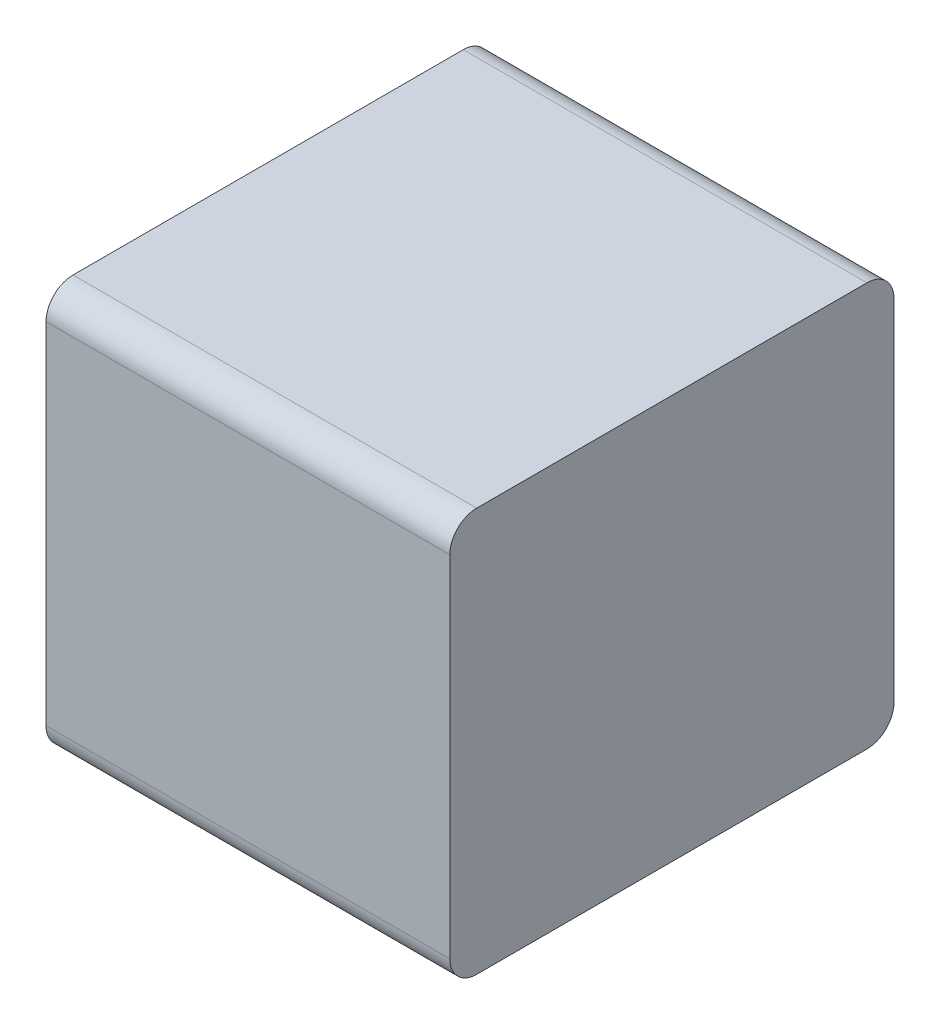
ISO-10303-21;
HEADER;
FILE_DESCRIPTION(('STEP AP214'),'2;1');
FILE_NAME('part.step','',(''),(''),'','','');
FILE_SCHEMA(('AUTOMOTIVE_DESIGN { 1 0 10303 214 1 1 1 1 }'));
ENDSEC;
DATA;
#1=APPLICATION_CONTEXT('core data for automotive mechanical design processes');
#2=APPLICATION_PROTOCOL_DEFINITION('international standard','automotive_design',2000,#1);
#3=PRODUCT_CONTEXT('',#1,'mechanical');
#4=PRODUCT('Part','Part','',(#3));
#5=PRODUCT_RELATED_PRODUCT_CATEGORY('part','',(#4));
#6=PRODUCT_DEFINITION_FORMATION('','',#4);
#7=PRODUCT_DEFINITION_CONTEXT('part definition',#1,'design');
#8=PRODUCT_DEFINITION('design','',#6,#7);
#9=PRODUCT_DEFINITION_SHAPE('','',#8);
#10=(LENGTH_UNIT() NAMED_UNIT(*) SI_UNIT(.MILLI.,.METRE.));
#11=(NAMED_UNIT(*) PLANE_ANGLE_UNIT() SI_UNIT($,.RADIAN.));
#12=(NAMED_UNIT(*) SI_UNIT($,.STERADIAN.) SOLID_ANGLE_UNIT());
#13=UNCERTAINTY_MEASURE_WITH_UNIT(LENGTH_MEASURE(1.E-05),#10,'distance_accuracy_value','');
#14=(GEOMETRIC_REPRESENTATION_CONTEXT(3) GLOBAL_UNCERTAINTY_ASSIGNED_CONTEXT((#13)) GLOBAL_UNIT_ASSIGNED_CONTEXT((#10,
#11,#12)) REPRESENTATION_CONTEXT('',''));
#15=CARTESIAN_POINT('',(0.,0.,0.));
#16=DIRECTION('',(0.,0.,1.));
#17=DIRECTION('',(1.,0.,0.));
#18=AXIS2_PLACEMENT_3D('',#15,#16,#17);
#19=CARTESIAN_POINT('',(0.0749999999999999,0.13,0.02));
#20=DIRECTION('',(1.,0.,0.));
#21=DIRECTION('',(0.,0.707106781186547,-0.707106781186548));
#22=AXIS2_PLACEMENT_3D('',#19,#20,#21);
#23=CYLINDRICAL_SURFACE('',#22,0.02);
#24=CARTESIAN_POINT('',(0.15,0.13,0.02));
#25=DIRECTION('',(-1.,0.,0.));
#26=DIRECTION('',(0.,0.707106781186547,-0.707106781186548));
#27=AXIS2_PLACEMENT_3D('',#24,#25,#26);
#28=CIRCLE('',#27,0.02);
#29=CARTESIAN_POINT('',(0.15,0.15,0.02));
#30=VERTEX_POINT('',#29);
#31=CARTESIAN_POINT('',(0.15,0.13,0.));
#32=VERTEX_POINT('',#31);
#33=EDGE_CURVE('E11',#30,#32,#28,.T.);
#34=ORIENTED_EDGE('',*,*,#33,.T.);
#35=DIRECTION('',(-1.,0.,0.));
#36=VECTOR('',#35,1.);
#37=CARTESIAN_POINT('',(0.0749999999999999,0.13,0.));
#38=LINE('',#37,#36);
#39=CARTESIAN_POINT('',(-0.15,0.13,0.));
#40=VERTEX_POINT('',#39);
#41=EDGE_CURVE('E24',#32,#40,#38,.T.);
#42=ORIENTED_EDGE('',*,*,#41,.T.);
#43=CARTESIAN_POINT('',(-0.15,0.13,0.02));
#44=DIRECTION('',(1.,0.,0.));
#45=DIRECTION('',(0.,0.707106781186547,-0.707106781186548));
#46=AXIS2_PLACEMENT_3D('',#43,#44,#45);
#47=CIRCLE('',#46,0.02);
#48=CARTESIAN_POINT('',(-0.15,0.15,0.02));
#49=VERTEX_POINT('',#48);
#50=EDGE_CURVE('E142',#40,#49,#47,.T.);
#51=ORIENTED_EDGE('',*,*,#50,.T.);
#52=DIRECTION('',(1.,0.,0.));
#53=VECTOR('',#52,1.);
#54=CARTESIAN_POINT('',(0.0749999999999999,0.15,0.02));
#55=LINE('',#54,#53);
#56=EDGE_CURVE('E140',#49,#30,#55,.T.);
#57=ORIENTED_EDGE('',*,*,#56,.T.);
#58=EDGE_LOOP('',(#34,#42,#51,#57));
#59=FACE_BOUND('',#58,.T.);
#60=ADVANCED_FACE('F17',(#59),#23,.T.);
#61=CARTESIAN_POINT('',(0.15,0.15,0.));
#62=DIRECTION('',(0.,1.,0.));
#63=DIRECTION('',(-1.,0.,0.));
#64=AXIS2_PLACEMENT_3D('',#61,#62,#63);
#65=PLANE('',#64);
#66=ORIENTED_EDGE('',*,*,#56,.F.);
#67=DIRECTION('',(0.,0.,1.));
#68=VECTOR('',#67,1.);
#69=CARTESIAN_POINT('',(-0.15,0.15,0.));
#70=LINE('',#69,#68);
#71=CARTESIAN_POINT('',(-0.15,0.15,0.31));
#72=VERTEX_POINT('',#71);
#73=EDGE_CURVE('E138',#49,#72,#70,.T.);
#74=ORIENTED_EDGE('',*,*,#73,.T.);
#75=DIRECTION('',(-1.,0.,0.));
#76=VECTOR('',#75,1.);
#77=CARTESIAN_POINT('',(0.0749999999999999,0.15,0.31));
#78=LINE('',#77,#76);
#79=CARTESIAN_POINT('',(0.15,0.15,0.31));
#80=VERTEX_POINT('',#79);
#81=EDGE_CURVE('E135',#80,#72,#78,.T.);
#82=ORIENTED_EDGE('',*,*,#81,.F.);
#83=DIRECTION('',(0.,0.,1.));
#84=VECTOR('',#83,1.);
#85=CARTESIAN_POINT('',(0.15,0.15,0.));
#86=LINE('',#85,#84);
#87=EDGE_CURVE('E133',#30,#80,#86,.T.);
#88=ORIENTED_EDGE('',*,*,#87,.F.);
#89=EDGE_LOOP('',(#66,#74,#82,#88));
#90=FACE_BOUND('',#89,.T.);
#91=ADVANCED_FACE('F163',(#90),#65,.T.);
#92=CARTESIAN_POINT('',(-0.15,0.15,0.));
#93=DIRECTION('',(-1.,0.,0.));
#94=DIRECTION('',(0.,-1.,0.));
#95=AXIS2_PLACEMENT_3D('',#92,#93,#94);
#96=PLANE('',#95);
#97=ORIENTED_EDGE('',*,*,#50,.F.);
#98=DIRECTION('',(0.,1.,0.));
#99=VECTOR('',#98,1.);
#100=CARTESIAN_POINT('',(-0.15,-0.15,0.));
#101=LINE('',#100,#99);
#102=CARTESIAN_POINT('',(-0.15,-0.13,0.));
#103=VERTEX_POINT('',#102);
#104=EDGE_CURVE('E130',#103,#40,#101,.T.);
#105=ORIENTED_EDGE('',*,*,#104,.F.);
#106=CARTESIAN_POINT('',(-0.15,-0.13,0.02));
#107=DIRECTION('',(1.,0.,0.));
#108=DIRECTION('',(0.,-0.707106781186548,-0.707106781186547));
#109=AXIS2_PLACEMENT_3D('',#106,#107,#108);
#110=CIRCLE('',#109,0.02);
#111=CARTESIAN_POINT('',(-0.15,-0.15,0.02));
#112=VERTEX_POINT('',#111);
#113=EDGE_CURVE('E127',#112,#103,#110,.T.);
#114=ORIENTED_EDGE('',*,*,#113,.F.);
#115=DIRECTION('',(0.,0.,1.));
#116=VECTOR('',#115,1.);
#117=CARTESIAN_POINT('',(-0.15,-0.15,0.));
#118=LINE('',#117,#116);
#119=CARTESIAN_POINT('',(-0.15,-0.15,0.31));
#120=VERTEX_POINT('',#119);
#121=EDGE_CURVE('E125',#112,#120,#118,.T.);
#122=ORIENTED_EDGE('',*,*,#121,.T.);
#123=CARTESIAN_POINT('',(-0.15,-0.13,0.31));
#124=DIRECTION('',(1.,0.,0.));
#125=DIRECTION('',(0.,-0.707106781186548,0.707106781186548));
#126=AXIS2_PLACEMENT_3D('',#123,#124,#125);
#127=CIRCLE('',#126,0.02);
#128=CARTESIAN_POINT('',(-0.15,-0.13,0.33));
#129=VERTEX_POINT('',#128);
#130=EDGE_CURVE('E123',#129,#120,#127,.T.);
#131=ORIENTED_EDGE('',*,*,#130,.F.);
#132=DIRECTION('',(0.,-1.,0.));
#133=VECTOR('',#132,1.);
#134=CARTESIAN_POINT('',(-0.15,-0.15,0.33));
#135=LINE('',#134,#133);
#136=CARTESIAN_POINT('',(-0.15,0.13,0.33));
#137=VERTEX_POINT('',#136);
#138=EDGE_CURVE('E101',#137,#129,#135,.T.);
#139=ORIENTED_EDGE('',*,*,#138,.F.);
#140=CARTESIAN_POINT('',(-0.15,0.13,0.31));
#141=DIRECTION('',(1.,0.,0.));
#142=DIRECTION('',(0.,0.707106781186547,0.707106781186548));
#143=AXIS2_PLACEMENT_3D('',#140,#141,#142);
#144=CIRCLE('',#143,0.02);
#145=EDGE_CURVE('E119',#72,#137,#144,.T.);
#146=ORIENTED_EDGE('',*,*,#145,.F.);
#147=ORIENTED_EDGE('',*,*,#73,.F.);
#148=EDGE_LOOP('',(#97,#105,#114,#122,#131,#139,#146,#147));
#149=FACE_BOUND('',#148,.T.);
#150=ADVANCED_FACE('F148',(#149),#96,.T.);
#151=CARTESIAN_POINT('',(-0.075,-0.13,0.02));
#152=DIRECTION('',(-1.,0.,0.));
#153=DIRECTION('',(0.,-0.707106781186548,-0.707106781186547));
#154=AXIS2_PLACEMENT_3D('',#151,#152,#153);
#155=CYLINDRICAL_SURFACE('',#154,0.02);
#156=ORIENTED_EDGE('',*,*,#113,.T.);
#157=DIRECTION('',(1.,0.,0.));
#158=VECTOR('',#157,1.);
#159=CARTESIAN_POINT('',(-0.075,-0.13,0.));
#160=LINE('',#159,#158);
#161=CARTESIAN_POINT('',(0.15,-0.13,0.));
#162=VERTEX_POINT('',#161);
#163=EDGE_CURVE('E117',#103,#162,#160,.T.);
#164=ORIENTED_EDGE('',*,*,#163,.T.);
#165=CARTESIAN_POINT('',(0.15,-0.13,0.02));
#166=DIRECTION('',(-1.,0.,0.));
#167=DIRECTION('',(0.,-0.707106781186548,-0.707106781186547));
#168=AXIS2_PLACEMENT_3D('',#165,#166,#167);
#169=CIRCLE('',#168,0.02);
#170=CARTESIAN_POINT('',(0.15,-0.15,0.02));
#171=VERTEX_POINT('',#170);
#172=EDGE_CURVE('E115',#162,#171,#169,.T.);
#173=ORIENTED_EDGE('',*,*,#172,.T.);
#174=DIRECTION('',(-1.,0.,0.));
#175=VECTOR('',#174,1.);
#176=CARTESIAN_POINT('',(-0.075,-0.15,0.02));
#177=LINE('',#176,#175);
#178=EDGE_CURVE('E112',#171,#112,#177,.T.);
#179=ORIENTED_EDGE('',*,*,#178,.T.);
#180=EDGE_LOOP('',(#156,#164,#173,#179));
#181=FACE_BOUND('',#180,.T.);
#182=ADVANCED_FACE('F154',(#181),#155,.T.);
#183=CARTESIAN_POINT('',(-0.15,-0.15,0.));
#184=DIRECTION('',(0.,-1.,0.));
#185=DIRECTION('',(1.,0.,0.));
#186=AXIS2_PLACEMENT_3D('',#183,#184,#185);
#187=PLANE('',#186);
#188=ORIENTED_EDGE('',*,*,#178,.F.);
#189=DIRECTION('',(0.,0.,1.));
#190=VECTOR('',#189,1.);
#191=CARTESIAN_POINT('',(0.15,-0.15,0.));
#192=LINE('',#191,#190);
#193=CARTESIAN_POINT('',(0.15,-0.15,0.31));
#194=VERTEX_POINT('',#193);
#195=EDGE_CURVE('E110',#171,#194,#192,.T.);
#196=ORIENTED_EDGE('',*,*,#195,.T.);
#197=DIRECTION('',(1.,0.,0.));
#198=VECTOR('',#197,1.);
#199=CARTESIAN_POINT('',(-0.075,-0.15,0.31));
#200=LINE('',#199,#198);
#201=EDGE_CURVE('E96',#120,#194,#200,.T.);
#202=ORIENTED_EDGE('',*,*,#201,.F.);
#203=ORIENTED_EDGE('',*,*,#121,.F.);
#204=EDGE_LOOP('',(#188,#196,#202,#203));
#205=FACE_BOUND('',#204,.T.);
#206=ADVANCED_FACE('F157',(#205),#187,.T.);
#207=CARTESIAN_POINT('',(0.15,-0.15,0.));
#208=DIRECTION('',(1.,0.,0.));
#209=DIRECTION('',(0.,1.,0.));
#210=AXIS2_PLACEMENT_3D('',#207,#208,#209);
#211=PLANE('',#210);
#212=ORIENTED_EDGE('',*,*,#33,.F.);
#213=ORIENTED_EDGE('',*,*,#87,.T.);
#214=CARTESIAN_POINT('',(0.15,0.13,0.31));
#215=DIRECTION('',(-1.,0.,0.));
#216=DIRECTION('',(0.,0.707106781186547,0.707106781186548));
#217=AXIS2_PLACEMENT_3D('',#214,#215,#216);
#218=CIRCLE('',#217,0.02);
#219=CARTESIAN_POINT('',(0.15,0.13,0.33));
#220=VERTEX_POINT('',#219);
#221=EDGE_CURVE('E83',#220,#80,#218,.T.);
#222=ORIENTED_EDGE('',*,*,#221,.F.);
#223=DIRECTION('',(0.,1.,0.));
#224=VECTOR('',#223,1.);
#225=CARTESIAN_POINT('',(0.15,0.15,0.33));
#226=LINE('',#225,#224);
#227=CARTESIAN_POINT('',(0.15,-0.13,0.33));
#228=VERTEX_POINT('',#227);
#229=EDGE_CURVE('E77',#228,#220,#226,.T.);
#230=ORIENTED_EDGE('',*,*,#229,.F.);
#231=CARTESIAN_POINT('',(0.15,-0.13,0.31));
#232=DIRECTION('',(-1.,0.,0.));
#233=DIRECTION('',(0.,-0.707106781186548,0.707106781186548));
#234=AXIS2_PLACEMENT_3D('',#231,#232,#233);
#235=CIRCLE('',#234,0.02);
#236=EDGE_CURVE('E81',#194,#228,#235,.T.);
#237=ORIENTED_EDGE('',*,*,#236,.F.);
#238=ORIENTED_EDGE('',*,*,#195,.F.);
#239=ORIENTED_EDGE('',*,*,#172,.F.);
#240=DIRECTION('',(0.,-1.,0.));
#241=VECTOR('',#240,1.);
#242=CARTESIAN_POINT('',(0.15,0.15,0.));
#243=LINE('',#242,#241);
#244=EDGE_CURVE('E97',#32,#162,#243,.T.);
#245=ORIENTED_EDGE('',*,*,#244,.F.);
#246=EDGE_LOOP('',(#212,#213,#222,#230,#237,#238,#239,#245));
#247=FACE_BOUND('',#246,.T.);
#248=ADVANCED_FACE('F79',(#247),#211,.T.);
#249=CARTESIAN_POINT('',(0.0749999999999999,0.13,0.31));
#250=DIRECTION('',(-1.,0.,0.));
#251=DIRECTION('',(0.,0.707106781186547,0.707106781186548));
#252=AXIS2_PLACEMENT_3D('',#249,#250,#251);
#253=CYLINDRICAL_SURFACE('',#252,0.02);
#254=ORIENTED_EDGE('',*,*,#145,.T.);
#255=DIRECTION('',(1.,0.,0.));
#256=VECTOR('',#255,1.);
#257=CARTESIAN_POINT('',(0.0749999999999999,0.13,0.33));
#258=LINE('',#257,#256);
#259=EDGE_CURVE('E102',#137,#220,#258,.T.);
#260=ORIENTED_EDGE('',*,*,#259,.T.);
#261=ORIENTED_EDGE('',*,*,#221,.T.);
#262=ORIENTED_EDGE('',*,*,#81,.T.);
#263=EDGE_LOOP('',(#254,#260,#261,#262));
#264=FACE_BOUND('',#263,.T.);
#265=ADVANCED_FACE('F160',(#264),#253,.T.);
#266=CARTESIAN_POINT('',(0.,0.,0.33));
#267=DIRECTION('',(0.,0.,1.));
#268=DIRECTION('',(1.,0.,0.));
#269=AXIS2_PLACEMENT_3D('',#266,#267,#268);
#270=PLANE('',#269);
#271=ORIENTED_EDGE('',*,*,#259,.F.);
#272=ORIENTED_EDGE('',*,*,#138,.T.);
#273=DIRECTION('',(-1.,0.,0.));
#274=VECTOR('',#273,1.);
#275=CARTESIAN_POINT('',(-0.075,-0.13,0.33));
#276=LINE('',#275,#274);
#277=EDGE_CURVE('E94',#228,#129,#276,.T.);
#278=ORIENTED_EDGE('',*,*,#277,.F.);
#279=ORIENTED_EDGE('',*,*,#229,.T.);
#280=EDGE_LOOP('',(#271,#272,#278,#279));
#281=FACE_BOUND('',#280,.T.);
#282=ADVANCED_FACE('F100',(#281),#270,.T.);
#283=CARTESIAN_POINT('',(-0.075,-0.13,0.31));
#284=DIRECTION('',(1.,0.,0.));
#285=DIRECTION('',(0.,-0.707106781186548,0.707106781186548));
#286=AXIS2_PLACEMENT_3D('',#283,#284,#285);
#287=CYLINDRICAL_SURFACE('',#286,0.02);
#288=ORIENTED_EDGE('',*,*,#236,.T.);
#289=ORIENTED_EDGE('',*,*,#277,.T.);
#290=ORIENTED_EDGE('',*,*,#130,.T.);
#291=ORIENTED_EDGE('',*,*,#201,.T.);
#292=EDGE_LOOP('',(#288,#289,#290,#291));
#293=FACE_BOUND('',#292,.T.);
#294=ADVANCED_FACE('F92',(#293),#287,.T.);
#295=CARTESIAN_POINT('',(0.,0.,0.));
#296=DIRECTION('',(0.,0.,1.));
#297=DIRECTION('',(1.,0.,0.));
#298=AXIS2_PLACEMENT_3D('',#295,#296,#297);
#299=PLANE('',#298);
#300=ORIENTED_EDGE('',*,*,#41,.F.);
#301=ORIENTED_EDGE('',*,*,#244,.T.);
#302=ORIENTED_EDGE('',*,*,#163,.F.);
#303=ORIENTED_EDGE('',*,*,#104,.T.);
#304=EDGE_LOOP('',(#300,#301,#302,#303));
#305=FACE_BOUND('',#304,.T.);
#306=ADVANCED_FACE('F151',(#305),#299,.F.);
#307=CLOSED_SHELL('',(#60,#91,#150,#182,#206,#248,#265,#282,#294,#306));
#308=MANIFOLD_SOLID_BREP('B1',#307);
#309=ADVANCED_BREP_SHAPE_REPRESENTATION('',(#18,#308),#14);
#310=SHAPE_DEFINITION_REPRESENTATION(#9,#309);
ENDSEC;
END-ISO-10303-21;
